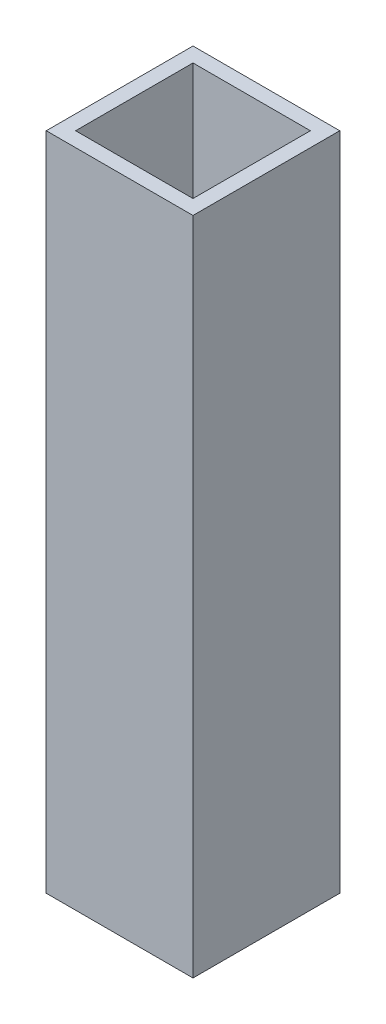
ISO-10303-21;
HEADER;
FILE_DESCRIPTION(('STEP AP214'),'2;1');
FILE_NAME('part.step','',(''),(''),'','','');
FILE_SCHEMA(('AUTOMOTIVE_DESIGN { 1 0 10303 214 1 1 1 1 }'));
ENDSEC;
DATA;
#1=APPLICATION_CONTEXT('core data for automotive mechanical design processes');
#2=APPLICATION_PROTOCOL_DEFINITION('international standard','automotive_design',2000,#1);
#3=PRODUCT_CONTEXT('',#1,'mechanical');
#4=PRODUCT('Part','Part','',(#3));
#5=PRODUCT_RELATED_PRODUCT_CATEGORY('part','',(#4));
#6=PRODUCT_DEFINITION_FORMATION('','',#4);
#7=PRODUCT_DEFINITION_CONTEXT('part definition',#1,'design');
#8=PRODUCT_DEFINITION('design','',#6,#7);
#9=PRODUCT_DEFINITION_SHAPE('','',#8);
#10=(LENGTH_UNIT() NAMED_UNIT(*) SI_UNIT(.MILLI.,.METRE.));
#11=(NAMED_UNIT(*) PLANE_ANGLE_UNIT() SI_UNIT($,.RADIAN.));
#12=(NAMED_UNIT(*) SI_UNIT($,.STERADIAN.) SOLID_ANGLE_UNIT());
#13=UNCERTAINTY_MEASURE_WITH_UNIT(LENGTH_MEASURE(1.E-05),#10,'distance_accuracy_value','');
#14=(GEOMETRIC_REPRESENTATION_CONTEXT(3) GLOBAL_UNCERTAINTY_ASSIGNED_CONTEXT((#13)) GLOBAL_UNIT_ASSIGNED_CONTEXT((#10,
#11,#12)) REPRESENTATION_CONTEXT('',''));
#15=CARTESIAN_POINT('',(0.,0.,0.));
#16=DIRECTION('',(0.,0.,1.));
#17=DIRECTION('',(1.,0.,0.));
#18=AXIS2_PLACEMENT_3D('',#15,#16,#17);
#19=CARTESIAN_POINT('',(0.,114.3,0.));
#20=DIRECTION('',(0.,1.,0.));
#21=DIRECTION('',(0.,0.,1.));
#22=AXIS2_PLACEMENT_3D('',#19,#20,#21);
#23=PLANE('',#22);
#24=DIRECTION('',(0.,0.,-1.));
#25=VECTOR('',#24,1.);
#26=CARTESIAN_POINT('',(12.7,114.3,-12.7));
#27=LINE('',#26,#25);
#28=CARTESIAN_POINT('',(12.7,114.3,12.7));
#29=VERTEX_POINT('',#28);
#30=CARTESIAN_POINT('',(12.7,114.3,-12.7));
#31=VERTEX_POINT('',#30);
#32=EDGE_CURVE('E136',#29,#31,#27,.T.);
#33=ORIENTED_EDGE('',*,*,#32,.T.);
#34=DIRECTION('',(-1.,0.,0.));
#35=VECTOR('',#34,1.);
#36=CARTESIAN_POINT('',(-12.7,114.3,-12.7));
#37=LINE('',#36,#35);
#38=CARTESIAN_POINT('',(-12.7,114.3,-12.7));
#39=VERTEX_POINT('',#38);
#40=EDGE_CURVE('E139',#31,#39,#37,.T.);
#41=ORIENTED_EDGE('',*,*,#40,.T.);
#42=DIRECTION('',(0.,0.,1.));
#43=VECTOR('',#42,1.);
#44=CARTESIAN_POINT('',(-12.7,114.3,-12.7));
#45=LINE('',#44,#43);
#46=CARTESIAN_POINT('',(-12.7,114.3,12.7));
#47=VERTEX_POINT('',#46);
#48=EDGE_CURVE('E142',#39,#47,#45,.T.);
#49=ORIENTED_EDGE('',*,*,#48,.T.);
#50=DIRECTION('',(1.,0.,0.));
#51=VECTOR('',#50,1.);
#52=CARTESIAN_POINT('',(-12.7,114.3,12.7));
#53=LINE('',#52,#51);
#54=EDGE_CURVE('E144',#47,#29,#53,.T.);
#55=ORIENTED_EDGE('',*,*,#54,.T.);
#56=EDGE_LOOP('',(#33,#41,#49,#55));
#57=FACE_BOUND('',#56,.T.);
#58=DIRECTION('',(1.,0.,0.));
#59=VECTOR('',#58,1.);
#60=CARTESIAN_POINT('',(-10.16,114.3,10.16));
#61=LINE('',#60,#59);
#62=CARTESIAN_POINT('',(-10.16,114.3,10.16));
#63=VERTEX_POINT('',#62);
#64=CARTESIAN_POINT('',(10.16,114.3,10.16));
#65=VERTEX_POINT('',#64);
#66=EDGE_CURVE('E108',#63,#65,#61,.T.);
#67=ORIENTED_EDGE('',*,*,#66,.F.);
#68=DIRECTION('',(0.,0.,1.));
#69=VECTOR('',#68,1.);
#70=CARTESIAN_POINT('',(-10.16,114.3,-10.16));
#71=LINE('',#70,#69);
#72=CARTESIAN_POINT('',(-10.16,114.3,-10.16));
#73=VERTEX_POINT('',#72);
#74=EDGE_CURVE('E100',#73,#63,#71,.T.);
#75=ORIENTED_EDGE('',*,*,#74,.F.);
#76=DIRECTION('',(-1.,0.,0.));
#77=VECTOR('',#76,1.);
#78=CARTESIAN_POINT('',(-10.16,114.3,-10.16));
#79=LINE('',#78,#77);
#80=CARTESIAN_POINT('',(10.16,114.3,-10.16));
#81=VERTEX_POINT('',#80);
#82=EDGE_CURVE('E122',#81,#73,#79,.T.);
#83=ORIENTED_EDGE('',*,*,#82,.F.);
#84=DIRECTION('',(0.,0.,-1.));
#85=VECTOR('',#84,1.);
#86=CARTESIAN_POINT('',(10.16,114.3,-10.16));
#87=LINE('',#86,#85);
#88=EDGE_CURVE('E120',#65,#81,#87,.T.);
#89=ORIENTED_EDGE('',*,*,#88,.F.);
#90=EDGE_LOOP('',(#67,#75,#83,#89));
#91=FACE_BOUND('',#90,.T.);
#92=ADVANCED_FACE('F35',(#57,#91),#23,.T.);
#93=CARTESIAN_POINT('',(0.,0.,0.));
#94=DIRECTION('',(0.,1.,0.));
#95=DIRECTION('',(0.,0.,1.));
#96=AXIS2_PLACEMENT_3D('',#93,#94,#95);
#97=PLANE('',#96);
#98=DIRECTION('',(0.,0.,-1.));
#99=VECTOR('',#98,1.);
#100=CARTESIAN_POINT('',(12.7,0.,-12.7));
#101=LINE('',#100,#99);
#102=CARTESIAN_POINT('',(12.7,0.,12.7));
#103=VERTEX_POINT('',#102);
#104=CARTESIAN_POINT('',(12.7,0.,-12.7));
#105=VERTEX_POINT('',#104);
#106=EDGE_CURVE('E116',#103,#105,#101,.T.);
#107=ORIENTED_EDGE('',*,*,#106,.F.);
#108=DIRECTION('',(1.,0.,0.));
#109=VECTOR('',#108,1.);
#110=CARTESIAN_POINT('',(-12.7,0.,12.7));
#111=LINE('',#110,#109);
#112=CARTESIAN_POINT('',(-12.7,0.,12.7));
#113=VERTEX_POINT('',#112);
#114=EDGE_CURVE('E140',#113,#103,#111,.T.);
#115=ORIENTED_EDGE('',*,*,#114,.F.);
#116=DIRECTION('',(0.,0.,1.));
#117=VECTOR('',#116,1.);
#118=CARTESIAN_POINT('',(-12.7,0.,-12.7));
#119=LINE('',#118,#117);
#120=CARTESIAN_POINT('',(-12.7,0.,-12.7));
#121=VERTEX_POINT('',#120);
#122=EDGE_CURVE('E151',#121,#113,#119,.T.);
#123=ORIENTED_EDGE('',*,*,#122,.F.);
#124=DIRECTION('',(-1.,0.,0.));
#125=VECTOR('',#124,1.);
#126=CARTESIAN_POINT('',(-12.7,0.,-12.7));
#127=LINE('',#126,#125);
#128=EDGE_CURVE('E149',#105,#121,#127,.T.);
#129=ORIENTED_EDGE('',*,*,#128,.F.);
#130=EDGE_LOOP('',(#107,#115,#123,#129));
#131=FACE_BOUND('',#130,.T.);
#132=DIRECTION('',(0.,0.,1.));
#133=VECTOR('',#132,1.);
#134=CARTESIAN_POINT('',(-10.16,0.,-10.16));
#135=LINE('',#134,#133);
#136=CARTESIAN_POINT('',(-10.16,0.,-10.16));
#137=VERTEX_POINT('',#136);
#138=CARTESIAN_POINT('',(-10.16,0.,10.16));
#139=VERTEX_POINT('',#138);
#140=EDGE_CURVE('E58',#137,#139,#135,.T.);
#141=ORIENTED_EDGE('',*,*,#140,.T.);
#142=DIRECTION('',(1.,0.,0.));
#143=VECTOR('',#142,1.);
#144=CARTESIAN_POINT('',(-10.16,0.,10.16));
#145=LINE('',#144,#143);
#146=CARTESIAN_POINT('',(10.16,0.,10.16));
#147=VERTEX_POINT('',#146);
#148=EDGE_CURVE('E115',#139,#147,#145,.T.);
#149=ORIENTED_EDGE('',*,*,#148,.T.);
#150=DIRECTION('',(0.,0.,-1.));
#151=VECTOR('',#150,1.);
#152=CARTESIAN_POINT('',(10.16,0.,-10.16));
#153=LINE('',#152,#151);
#154=CARTESIAN_POINT('',(10.16,0.,-10.16));
#155=VERTEX_POINT('',#154);
#156=EDGE_CURVE('E128',#147,#155,#153,.T.);
#157=ORIENTED_EDGE('',*,*,#156,.T.);
#158=DIRECTION('',(-1.,0.,0.));
#159=VECTOR('',#158,1.);
#160=CARTESIAN_POINT('',(-10.16,0.,-10.16));
#161=LINE('',#160,#159);
#162=EDGE_CURVE('E109',#155,#137,#161,.T.);
#163=ORIENTED_EDGE('',*,*,#162,.T.);
#164=EDGE_LOOP('',(#141,#149,#157,#163));
#165=FACE_BOUND('',#164,.T.);
#166=ADVANCED_FACE('F169',(#131,#165),#97,.F.);
#167=CARTESIAN_POINT('',(12.7,114.3,-12.7));
#168=DIRECTION('',(-1.,0.,0.));
#169=DIRECTION('',(0.,0.,1.));
#170=AXIS2_PLACEMENT_3D('',#167,#168,#169);
#171=PLANE('',#170);
#172=ORIENTED_EDGE('',*,*,#106,.T.);
#173=DIRECTION('',(0.,-1.,0.));
#174=VECTOR('',#173,1.);
#175=CARTESIAN_POINT('',(12.7,114.3,-12.7));
#176=LINE('',#175,#174);
#177=EDGE_CURVE('E11',#31,#105,#176,.T.);
#178=ORIENTED_EDGE('',*,*,#177,.F.);
#179=ORIENTED_EDGE('',*,*,#32,.F.);
#180=DIRECTION('',(0.,-1.,0.));
#181=VECTOR('',#180,1.);
#182=CARTESIAN_POINT('',(12.7,114.3,12.7));
#183=LINE('',#182,#181);
#184=EDGE_CURVE('E146',#29,#103,#183,.T.);
#185=ORIENTED_EDGE('',*,*,#184,.T.);
#186=EDGE_LOOP('',(#172,#178,#179,#185));
#187=FACE_BOUND('',#186,.T.);
#188=ADVANCED_FACE('F37',(#187),#171,.F.);
#189=CARTESIAN_POINT('',(-12.7,114.3,-12.7));
#190=DIRECTION('',(0.,0.,1.));
#191=DIRECTION('',(1.,0.,0.));
#192=AXIS2_PLACEMENT_3D('',#189,#190,#191);
#193=PLANE('',#192);
#194=ORIENTED_EDGE('',*,*,#128,.T.);
#195=DIRECTION('',(0.,-1.,0.));
#196=VECTOR('',#195,1.);
#197=CARTESIAN_POINT('',(-12.7,114.3,-12.7));
#198=LINE('',#197,#196);
#199=EDGE_CURVE('E43',#39,#121,#198,.T.);
#200=ORIENTED_EDGE('',*,*,#199,.F.);
#201=ORIENTED_EDGE('',*,*,#40,.F.);
#202=ORIENTED_EDGE('',*,*,#177,.T.);
#203=EDGE_LOOP('',(#194,#200,#201,#202));
#204=FACE_BOUND('',#203,.T.);
#205=ADVANCED_FACE('F179',(#204),#193,.F.);
#206=CARTESIAN_POINT('',(-12.7,114.3,-12.7));
#207=DIRECTION('',(1.,0.,0.));
#208=DIRECTION('',(0.,0.,-1.));
#209=AXIS2_PLACEMENT_3D('',#206,#207,#208);
#210=PLANE('',#209);
#211=ORIENTED_EDGE('',*,*,#122,.T.);
#212=DIRECTION('',(0.,-1.,0.));
#213=VECTOR('',#212,1.);
#214=CARTESIAN_POINT('',(-12.7,114.3,12.7));
#215=LINE('',#214,#213);
#216=EDGE_CURVE('E156',#47,#113,#215,.T.);
#217=ORIENTED_EDGE('',*,*,#216,.F.);
#218=ORIENTED_EDGE('',*,*,#48,.F.);
#219=ORIENTED_EDGE('',*,*,#199,.T.);
#220=EDGE_LOOP('',(#211,#217,#218,#219));
#221=FACE_BOUND('',#220,.T.);
#222=ADVANCED_FACE('F163',(#221),#210,.F.);
#223=CARTESIAN_POINT('',(-12.7,114.3,12.7));
#224=DIRECTION('',(0.,0.,-1.));
#225=DIRECTION('',(-1.,0.,0.));
#226=AXIS2_PLACEMENT_3D('',#223,#224,#225);
#227=PLANE('',#226);
#228=ORIENTED_EDGE('',*,*,#114,.T.);
#229=ORIENTED_EDGE('',*,*,#184,.F.);
#230=ORIENTED_EDGE('',*,*,#54,.F.);
#231=ORIENTED_EDGE('',*,*,#216,.T.);
#232=EDGE_LOOP('',(#228,#229,#230,#231));
#233=FACE_BOUND('',#232,.T.);
#234=ADVANCED_FACE('F173',(#233),#227,.F.);
#235=CARTESIAN_POINT('',(-10.16,114.3,-10.16));
#236=DIRECTION('',(1.,0.,0.));
#237=DIRECTION('',(0.,0.,-1.));
#238=AXIS2_PLACEMENT_3D('',#235,#236,#237);
#239=PLANE('',#238);
#240=ORIENTED_EDGE('',*,*,#140,.F.);
#241=DIRECTION('',(0.,-1.,0.));
#242=VECTOR('',#241,1.);
#243=CARTESIAN_POINT('',(-10.16,114.3,-10.16));
#244=LINE('',#243,#242);
#245=EDGE_CURVE('E104',#73,#137,#244,.T.);
#246=ORIENTED_EDGE('',*,*,#245,.F.);
#247=ORIENTED_EDGE('',*,*,#74,.T.);
#248=DIRECTION('',(0.,-1.,0.));
#249=VECTOR('',#248,1.);
#250=CARTESIAN_POINT('',(-10.16,114.3,10.16));
#251=LINE('',#250,#249);
#252=EDGE_CURVE('E103',#63,#139,#251,.T.);
#253=ORIENTED_EDGE('',*,*,#252,.T.);
#254=EDGE_LOOP('',(#240,#246,#247,#253));
#255=FACE_BOUND('',#254,.T.);
#256=ADVANCED_FACE('F102',(#255),#239,.T.);
#257=CARTESIAN_POINT('',(-10.16,114.3,10.16));
#258=DIRECTION('',(0.,0.,-1.));
#259=DIRECTION('',(-1.,0.,0.));
#260=AXIS2_PLACEMENT_3D('',#257,#258,#259);
#261=PLANE('',#260);
#262=ORIENTED_EDGE('',*,*,#148,.F.);
#263=ORIENTED_EDGE('',*,*,#252,.F.);
#264=ORIENTED_EDGE('',*,*,#66,.T.);
#265=DIRECTION('',(0.,-1.,0.));
#266=VECTOR('',#265,1.);
#267=CARTESIAN_POINT('',(10.16,114.3,10.16));
#268=LINE('',#267,#266);
#269=EDGE_CURVE('E117',#65,#147,#268,.T.);
#270=ORIENTED_EDGE('',*,*,#269,.T.);
#271=EDGE_LOOP('',(#262,#263,#264,#270));
#272=FACE_BOUND('',#271,.T.);
#273=ADVANCED_FACE('F112',(#272),#261,.T.);
#274=CARTESIAN_POINT('',(10.16,114.3,-10.16));
#275=DIRECTION('',(-1.,0.,0.));
#276=DIRECTION('',(0.,0.,1.));
#277=AXIS2_PLACEMENT_3D('',#274,#275,#276);
#278=PLANE('',#277);
#279=ORIENTED_EDGE('',*,*,#156,.F.);
#280=ORIENTED_EDGE('',*,*,#269,.F.);
#281=ORIENTED_EDGE('',*,*,#88,.T.);
#282=DIRECTION('',(0.,-1.,0.));
#283=VECTOR('',#282,1.);
#284=CARTESIAN_POINT('',(10.16,114.3,-10.16));
#285=LINE('',#284,#283);
#286=EDGE_CURVE('E50',#81,#155,#285,.T.);
#287=ORIENTED_EDGE('',*,*,#286,.T.);
#288=EDGE_LOOP('',(#279,#280,#281,#287));
#289=FACE_BOUND('',#288,.T.);
#290=ADVANCED_FACE('F202',(#289),#278,.T.);
#291=CARTESIAN_POINT('',(-10.16,114.3,-10.16));
#292=DIRECTION('',(0.,0.,1.));
#293=DIRECTION('',(1.,0.,0.));
#294=AXIS2_PLACEMENT_3D('',#291,#292,#293);
#295=PLANE('',#294);
#296=ORIENTED_EDGE('',*,*,#162,.F.);
#297=ORIENTED_EDGE('',*,*,#286,.F.);
#298=ORIENTED_EDGE('',*,*,#82,.T.);
#299=ORIENTED_EDGE('',*,*,#245,.T.);
#300=EDGE_LOOP('',(#296,#297,#298,#299));
#301=FACE_BOUND('',#300,.T.);
#302=ADVANCED_FACE('F206',(#301),#295,.T.);
#303=CLOSED_SHELL('',(#92,#166,#188,#205,#222,#234,#256,#273,#290,#302));
#304=MANIFOLD_SOLID_BREP('B2',#303);
#305=ADVANCED_BREP_SHAPE_REPRESENTATION('',(#18,#304),#14);
#306=SHAPE_DEFINITION_REPRESENTATION(#9,#305);
ENDSEC;
END-ISO-10303-21;
